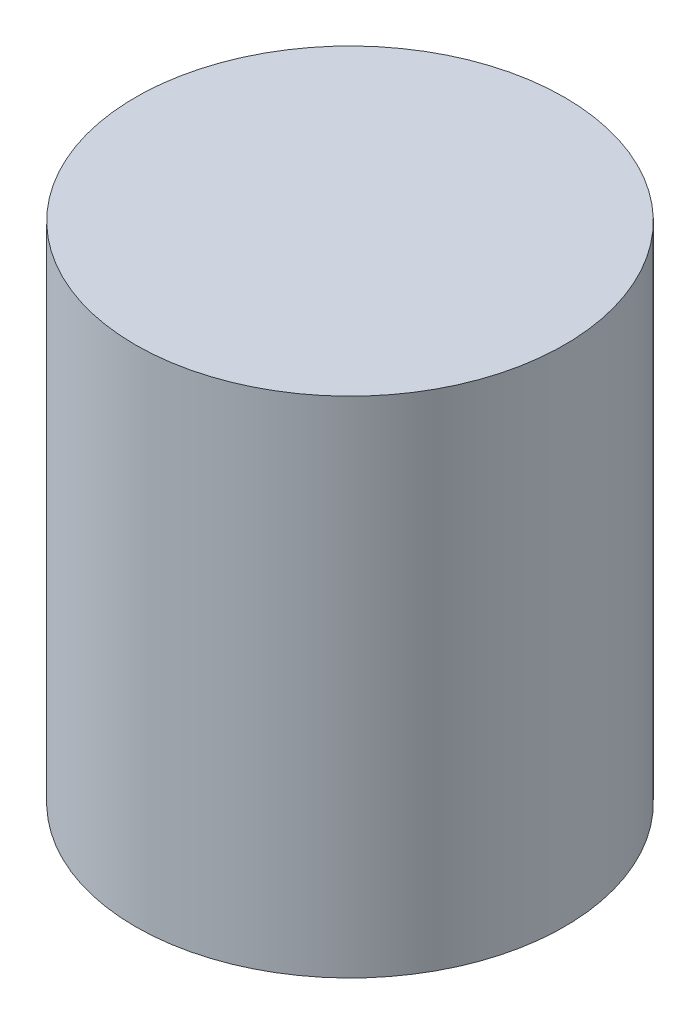
ISO-10303-21;
HEADER;
FILE_DESCRIPTION(('STEP AP214'),'2;1');
FILE_NAME('part.step','',(''),(''),'','','');
FILE_SCHEMA(('AUTOMOTIVE_DESIGN { 1 0 10303 214 1 1 1 1 }'));
ENDSEC;
DATA;
#1=APPLICATION_CONTEXT('core data for automotive mechanical design processes');
#2=APPLICATION_PROTOCOL_DEFINITION('international standard','automotive_design',2000,#1);
#3=PRODUCT_CONTEXT('',#1,'mechanical');
#4=PRODUCT('Part','Part','',(#3));
#5=PRODUCT_RELATED_PRODUCT_CATEGORY('part','',(#4));
#6=PRODUCT_DEFINITION_FORMATION('','',#4);
#7=PRODUCT_DEFINITION_CONTEXT('part definition',#1,'design');
#8=PRODUCT_DEFINITION('design','',#6,#7);
#9=PRODUCT_DEFINITION_SHAPE('','',#8);
#10=(LENGTH_UNIT() NAMED_UNIT(*) SI_UNIT(.MILLI.,.METRE.));
#11=(NAMED_UNIT(*) PLANE_ANGLE_UNIT() SI_UNIT($,.RADIAN.));
#12=(NAMED_UNIT(*) SI_UNIT($,.STERADIAN.) SOLID_ANGLE_UNIT());
#13=UNCERTAINTY_MEASURE_WITH_UNIT(LENGTH_MEASURE(1.E-05),#10,'distance_accuracy_value','');
#14=(GEOMETRIC_REPRESENTATION_CONTEXT(3) GLOBAL_UNCERTAINTY_ASSIGNED_CONTEXT((#13)) GLOBAL_UNIT_ASSIGNED_CONTEXT((#10,
#11,#12)) REPRESENTATION_CONTEXT('',''));
#15=CARTESIAN_POINT('',(0.,0.,0.));
#16=DIRECTION('',(0.,0.,1.));
#17=DIRECTION('',(1.,0.,0.));
#18=AXIS2_PLACEMENT_3D('',#15,#16,#17);
#19=CARTESIAN_POINT('',(0.,145.,0.));
#20=DIRECTION('',(0.,-1.,0.));
#21=DIRECTION('',(0.,0.,-1.));
#22=AXIS2_PLACEMENT_3D('',#19,#20,#21);
#23=CYLINDRICAL_SURFACE('',#22,63.);
#24=CARTESIAN_POINT('',(0.,0.,0.));
#25=DIRECTION('',(0.,1.,0.));
#26=DIRECTION('',(0.,0.,1.));
#27=AXIS2_PLACEMENT_3D('',#24,#25,#26);
#28=CIRCLE('',#27,63.);
#29=CARTESIAN_POINT('',(0.,0.,63.));
#30=VERTEX_POINT('',#29);
#31=EDGE_CURVE('E10',#30,#30,#28,.T.);
#32=ORIENTED_EDGE('',*,*,#31,.T.);
#33=EDGE_LOOP('',(#32));
#34=FACE_BOUND('',#33,.T.);
#35=CARTESIAN_POINT('',(0.,148.,0.));
#36=DIRECTION('',(0.,1.,0.));
#37=DIRECTION('',(0.,0.,1.));
#38=AXIS2_PLACEMENT_3D('',#35,#36,#37);
#39=CIRCLE('',#38,63.);
#40=CARTESIAN_POINT('',(0.,148.,63.));
#41=VERTEX_POINT('',#40);
#42=EDGE_CURVE('E54',#41,#41,#39,.T.);
#43=ORIENTED_EDGE('',*,*,#42,.F.);
#44=EDGE_LOOP('',(#43));
#45=FACE_BOUND('',#44,.T.);
#46=ADVANCED_FACE('F39',(#34,#45),#23,.T.);
#47=CARTESIAN_POINT('',(0.,0.,0.));
#48=DIRECTION('',(0.,1.,0.));
#49=DIRECTION('',(0.,0.,1.));
#50=AXIS2_PLACEMENT_3D('',#47,#48,#49);
#51=PLANE('',#50);
#52=ORIENTED_EDGE('',*,*,#31,.F.);
#53=EDGE_LOOP('',(#52));
#54=FACE_BOUND('',#53,.T.);
#55=ADVANCED_FACE('F61',(#54),#51,.F.);
#56=CARTESIAN_POINT('',(0.,148.,0.));
#57=DIRECTION('',(0.,1.,0.));
#58=DIRECTION('',(0.,0.,1.));
#59=AXIS2_PLACEMENT_3D('',#56,#57,#58);
#60=PLANE('',#59);
#61=ORIENTED_EDGE('',*,*,#42,.T.);
#62=EDGE_LOOP('',(#61));
#63=FACE_BOUND('',#62,.T.);
#64=ADVANCED_FACE('F58',(#63),#60,.T.);
#65=CLOSED_SHELL('',(#46,#55,#64));
#66=CARTESIAN_POINT('',(0.,145.,0.));
#67=DIRECTION('',(0.,1.,0.));
#68=DIRECTION('',(0.,0.,1.));
#69=AXIS2_PLACEMENT_3D('',#66,#67,#68);
#70=PLANE('',#69);
#71=CARTESIAN_POINT('',(0.,145.,0.));
#72=DIRECTION('',(0.,1.,0.));
#73=DIRECTION('',(0.,0.,1.));
#74=AXIS2_PLACEMENT_3D('',#71,#72,#73);
#75=CIRCLE('',#74,60.);
#76=CARTESIAN_POINT('',(0.,145.,60.));
#77=VERTEX_POINT('',#76);
#78=EDGE_CURVE('E42',#77,#77,#75,.F.);
#79=ORIENTED_EDGE('',*,*,#78,.T.);
#80=EDGE_LOOP('',(#79));
#81=FACE_BOUND('',#80,.T.);
#82=ADVANCED_FACE('F79',(#81),#70,.F.);
#83=CARTESIAN_POINT('',(0.,3.,0.));
#84=DIRECTION('',(0.,1.,0.));
#85=DIRECTION('',(0.,0.,1.));
#86=AXIS2_PLACEMENT_3D('',#83,#84,#85);
#87=PLANE('',#86);
#88=CARTESIAN_POINT('',(0.,3.,0.));
#89=DIRECTION('',(0.,1.,0.));
#90=DIRECTION('',(0.,0.,1.));
#91=AXIS2_PLACEMENT_3D('',#88,#89,#90);
#92=CIRCLE('',#91,60.);
#93=CARTESIAN_POINT('',(0.,3.,60.));
#94=VERTEX_POINT('',#93);
#95=EDGE_CURVE('E50',#94,#94,#92,.T.);
#96=ORIENTED_EDGE('',*,*,#95,.T.);
#97=EDGE_LOOP('',(#96));
#98=FACE_BOUND('',#97,.T.);
#99=ADVANCED_FACE('F74',(#98),#87,.T.);
#100=CARTESIAN_POINT('',(0.,147.,0.));
#101=DIRECTION('',(0.,-1.,0.));
#102=DIRECTION('',(0.,0.,-1.));
#103=AXIS2_PLACEMENT_3D('',#100,#101,#102);
#104=CYLINDRICAL_SURFACE('',#103,60.);
#105=ORIENTED_EDGE('',*,*,#78,.F.);
#106=EDGE_LOOP('',(#105));
#107=FACE_BOUND('',#106,.T.);
#108=ORIENTED_EDGE('',*,*,#95,.F.);
#109=EDGE_LOOP('',(#108));
#110=FACE_BOUND('',#109,.T.);
#111=ADVANCED_FACE('F71',(#107,#110),#104,.F.);
#112=CLOSED_SHELL('',(#82,#99,#111));
#113=ORIENTED_CLOSED_SHELL('',*,#112,.T.);
#114=BREP_WITH_VOIDS('B2',#65,(#113));
#115=ADVANCED_BREP_SHAPE_REPRESENTATION('',(#18,#114),#14);
#116=SHAPE_DEFINITION_REPRESENTATION(#9,#115);
ENDSEC;
END-ISO-10303-21;
